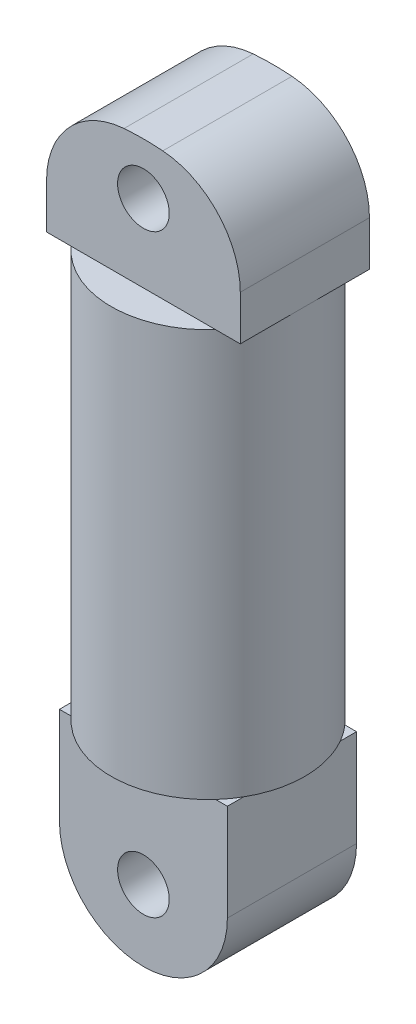
ISO-10303-21;
HEADER;
FILE_DESCRIPTION(('STEP AP214'),'2;1');
FILE_NAME('part.step','',(''),(''),'','','');
FILE_SCHEMA(('AUTOMOTIVE_DESIGN { 1 0 10303 214 1 1 1 1 }'));
ENDSEC;
DATA;
#1=APPLICATION_CONTEXT('core data for automotive mechanical design processes');
#2=APPLICATION_PROTOCOL_DEFINITION('international standard','automotive_design',2000,#1);
#3=PRODUCT_CONTEXT('',#1,'mechanical');
#4=PRODUCT('Part','Part','',(#3));
#5=PRODUCT_RELATED_PRODUCT_CATEGORY('part','',(#4));
#6=PRODUCT_DEFINITION_FORMATION('','',#4);
#7=PRODUCT_DEFINITION_CONTEXT('part definition',#1,'design');
#8=PRODUCT_DEFINITION('design','',#6,#7);
#9=PRODUCT_DEFINITION_SHAPE('','',#8);
#10=(LENGTH_UNIT() NAMED_UNIT(*) SI_UNIT(.MILLI.,.METRE.));
#11=(NAMED_UNIT(*) PLANE_ANGLE_UNIT() SI_UNIT($,.RADIAN.));
#12=(NAMED_UNIT(*) SI_UNIT($,.STERADIAN.) SOLID_ANGLE_UNIT());
#13=UNCERTAINTY_MEASURE_WITH_UNIT(LENGTH_MEASURE(1.E-05),#10,'distance_accuracy_value','');
#14=(GEOMETRIC_REPRESENTATION_CONTEXT(3) GLOBAL_UNCERTAINTY_ASSIGNED_CONTEXT((#13)) GLOBAL_UNIT_ASSIGNED_CONTEXT((#10,
#11,#12)) REPRESENTATION_CONTEXT('',''));
#15=CARTESIAN_POINT('',(0.,0.,0.));
#16=DIRECTION('',(0.,0.,1.));
#17=DIRECTION('',(1.,0.,0.));
#18=AXIS2_PLACEMENT_3D('',#15,#16,#17);
#19=CARTESIAN_POINT('',(0.,63.,0.));
#20=DIRECTION('',(0.,1.,0.));
#21=DIRECTION('',(0.,0.,1.));
#22=AXIS2_PLACEMENT_3D('',#19,#20,#21);
#23=PLANE('',#22);
#24=CARTESIAN_POINT('',(0.,63.,0.));
#25=DIRECTION('',(0.,1.,0.));
#26=DIRECTION('',(0.,0.,1.));
#27=AXIS2_PLACEMENT_3D('',#24,#25,#26);
#28=CIRCLE('',#27,15.);
#29=CARTESIAN_POINT('',(11.1803398874989,63.,-10.));
#30=VERTEX_POINT('',#29);
#31=CARTESIAN_POINT('',(-11.1803398874989,63.,-10.));
#32=VERTEX_POINT('',#31);
#33=EDGE_CURVE('E242',#30,#32,#28,.T.);
#34=ORIENTED_EDGE('',*,*,#33,.T.);
#35=DIRECTION('',(1.,0.,0.));
#36=VECTOR('',#35,1.);
#37=CARTESIAN_POINT('',(-15.,63.,-10.));
#38=LINE('',#37,#36);
#39=EDGE_CURVE('E11',#32,#30,#38,.T.);
#40=ORIENTED_EDGE('',*,*,#39,.T.);
#41=EDGE_LOOP('',(#34,#40));
#42=FACE_BOUND('',#41,.T.);
#43=ADVANCED_FACE('F36',(#42),#23,.T.);
#44=CARTESIAN_POINT('',(0.,0.,0.));
#45=DIRECTION('',(0.,1.,0.));
#46=DIRECTION('',(0.,0.,1.));
#47=AXIS2_PLACEMENT_3D('',#44,#45,#46);
#48=PLANE('',#47);
#49=DIRECTION('',(0.,0.,-1.));
#50=VECTOR('',#49,1.);
#51=CARTESIAN_POINT('',(-13.,0.,10.));
#52=LINE('',#51,#50);
#53=CARTESIAN_POINT('',(-13.,0.,7.48331477354789));
#54=VERTEX_POINT('',#53);
#55=CARTESIAN_POINT('',(-13.,0.,-7.48331477354789));
#56=VERTEX_POINT('',#55);
#57=EDGE_CURVE('E231',#54,#56,#52,.T.);
#58=ORIENTED_EDGE('',*,*,#57,.F.);
#59=CARTESIAN_POINT('',(0.,0.,0.));
#60=DIRECTION('',(0.,1.,0.));
#61=DIRECTION('',(0.,0.,1.));
#62=AXIS2_PLACEMENT_3D('',#59,#60,#61);
#63=CIRCLE('',#62,15.);
#64=EDGE_CURVE('E253',#56,#54,#63,.T.);
#65=ORIENTED_EDGE('',*,*,#64,.F.);
#66=EDGE_LOOP('',(#58,#65));
#67=FACE_BOUND('',#66,.T.);
#68=ADVANCED_FACE('F310',(#67),#48,.F.);
#69=DIRECTION('',(-1.,0.,0.));
#70=VECTOR('',#69,1.);
#71=CARTESIAN_POINT('',(-13.,0.,10.));
#72=LINE('',#71,#70);
#73=CARTESIAN_POINT('',(11.1803398874989,0.,10.));
#74=VERTEX_POINT('',#73);
#75=CARTESIAN_POINT('',(-11.1803398874989,0.,10.));
#76=VERTEX_POINT('',#75);
#77=EDGE_CURVE('E199',#74,#76,#72,.T.);
#78=ORIENTED_EDGE('',*,*,#77,.F.);
#79=EDGE_CURVE('E230',#76,#74,#63,.T.);
#80=ORIENTED_EDGE('',*,*,#79,.F.);
#81=EDGE_LOOP('',(#78,#80));
#82=FACE_BOUND('',#81,.T.);
#83=ADVANCED_FACE('F282',(#82),#48,.F.);
#84=CARTESIAN_POINT('',(11.1803398874989,0.,-10.));
#85=VERTEX_POINT('',#84);
#86=CARTESIAN_POINT('',(-11.1803398874989,0.,-10.));
#87=VERTEX_POINT('',#86);
#88=EDGE_CURVE('E258',#85,#87,#63,.T.);
#89=ORIENTED_EDGE('',*,*,#88,.F.);
#90=DIRECTION('',(-1.,0.,0.));
#91=VECTOR('',#90,1.);
#92=CARTESIAN_POINT('',(-13.,0.,-10.));
#93=LINE('',#92,#91);
#94=EDGE_CURVE('E210',#85,#87,#93,.T.);
#95=ORIENTED_EDGE('',*,*,#94,.T.);
#96=EDGE_LOOP('',(#89,#95));
#97=FACE_BOUND('',#96,.T.);
#98=ADVANCED_FACE('F323',(#97),#48,.F.);
#99=CARTESIAN_POINT('',(0.,63.,0.));
#100=DIRECTION('',(0.,-1.,0.));
#101=DIRECTION('',(0.,0.,-1.));
#102=AXIS2_PLACEMENT_3D('',#99,#100,#101);
#103=CYLINDRICAL_SURFACE('',#102,15.);
#104=CARTESIAN_POINT('',(11.1803398874989,63.,10.));
#105=VERTEX_POINT('',#104);
#106=CARTESIAN_POINT('',(15.,63.,0.));
#107=VERTEX_POINT('',#106);
#108=EDGE_CURVE('E232',#105,#107,#28,.T.);
#109=ORIENTED_EDGE('',*,*,#108,.F.);
#110=CARTESIAN_POINT('',(-11.1803398874989,63.,10.));
#111=VERTEX_POINT('',#110);
#112=EDGE_CURVE('E235',#111,#105,#28,.T.);
#113=ORIENTED_EDGE('',*,*,#112,.F.);
#114=CARTESIAN_POINT('',(-15.,63.,0.));
#115=VERTEX_POINT('',#114);
#116=EDGE_CURVE('E60',#115,#111,#28,.T.);
#117=ORIENTED_EDGE('',*,*,#116,.F.);
#118=EDGE_CURVE('E243',#32,#115,#28,.T.);
#119=ORIENTED_EDGE('',*,*,#118,.F.);
#120=ORIENTED_EDGE('',*,*,#33,.F.);
#121=EDGE_CURVE('E234',#107,#30,#28,.T.);
#122=ORIENTED_EDGE('',*,*,#121,.F.);
#123=EDGE_LOOP('',(#109,#113,#117,#119,#120,#122));
#124=FACE_BOUND('',#123,.T.);
#125=CARTESIAN_POINT('',(13.,0.,7.48331477354789));
#126=VERTEX_POINT('',#125);
#127=EDGE_CURVE('E40',#74,#126,#63,.T.);
#128=ORIENTED_EDGE('',*,*,#127,.T.);
#129=CARTESIAN_POINT('',(13.,0.,-7.48331477354789));
#130=VERTEX_POINT('',#129);
#131=EDGE_CURVE('E245',#126,#130,#63,.T.);
#132=ORIENTED_EDGE('',*,*,#131,.T.);
#133=EDGE_CURVE('E249',#130,#85,#63,.T.);
#134=ORIENTED_EDGE('',*,*,#133,.T.);
#135=ORIENTED_EDGE('',*,*,#88,.T.);
#136=EDGE_CURVE('E255',#87,#56,#63,.T.);
#137=ORIENTED_EDGE('',*,*,#136,.T.);
#138=ORIENTED_EDGE('',*,*,#64,.T.);
#139=EDGE_CURVE('E250',#54,#76,#63,.T.);
#140=ORIENTED_EDGE('',*,*,#139,.T.);
#141=ORIENTED_EDGE('',*,*,#79,.T.);
#142=EDGE_LOOP('',(#128,#132,#134,#135,#137,#138,#140,#141));
#143=FACE_BOUND('',#142,.T.);
#144=ADVANCED_FACE('F38',(#124,#143),#103,.T.);
#145=DIRECTION('',(1.,0.,0.));
#146=VECTOR('',#145,1.);
#147=CARTESIAN_POINT('',(-15.,63.,10.));
#148=LINE('',#147,#146);
#149=EDGE_CURVE('E45',#111,#105,#148,.T.);
#150=ORIENTED_EDGE('',*,*,#149,.F.);
#151=ORIENTED_EDGE('',*,*,#112,.T.);
#152=EDGE_LOOP('',(#150,#151));
#153=FACE_BOUND('',#152,.T.);
#154=ADVANCED_FACE('F312',(#153),#23,.T.);
#155=ORIENTED_EDGE('',*,*,#131,.F.);
#156=DIRECTION('',(0.,0.,-1.));
#157=VECTOR('',#156,1.);
#158=CARTESIAN_POINT('',(13.,0.,10.));
#159=LINE('',#158,#157);
#160=EDGE_CURVE('E221',#126,#130,#159,.T.);
#161=ORIENTED_EDGE('',*,*,#160,.T.);
#162=EDGE_LOOP('',(#155,#161));
#163=FACE_BOUND('',#162,.T.);
#164=ADVANCED_FACE('F268',(#163),#48,.F.);
#165=CARTESIAN_POINT('',(-13.,0.,10.));
#166=DIRECTION('',(0.,-1.,0.));
#167=DIRECTION('',(1.,0.,0.));
#168=AXIS2_PLACEMENT_3D('',#165,#166,#167);
#169=PLANE('',#168);
#170=ORIENTED_EDGE('',*,*,#127,.F.);
#171=CARTESIAN_POINT('',(13.,0.,10.));
#172=VERTEX_POINT('',#171);
#173=EDGE_CURVE('E194',#172,#74,#72,.T.);
#174=ORIENTED_EDGE('',*,*,#173,.F.);
#175=EDGE_CURVE('E217',#172,#126,#159,.T.);
#176=ORIENTED_EDGE('',*,*,#175,.T.);
#177=EDGE_LOOP('',(#170,#174,#176));
#178=FACE_BOUND('',#177,.T.);
#179=ADVANCED_FACE('F275',(#178),#169,.F.);
#180=ORIENTED_EDGE('',*,*,#133,.F.);
#181=CARTESIAN_POINT('',(13.,0.,-10.));
#182=VERTEX_POINT('',#181);
#183=EDGE_CURVE('E205',#130,#182,#159,.T.);
#184=ORIENTED_EDGE('',*,*,#183,.T.);
#185=EDGE_CURVE('E206',#182,#85,#93,.T.);
#186=ORIENTED_EDGE('',*,*,#185,.T.);
#187=EDGE_LOOP('',(#180,#184,#186));
#188=FACE_BOUND('',#187,.T.);
#189=ADVANCED_FACE('F265',(#188),#169,.F.);
#190=ORIENTED_EDGE('',*,*,#136,.F.);
#191=CARTESIAN_POINT('',(-13.,0.,-10.));
#192=VERTEX_POINT('',#191);
#193=EDGE_CURVE('E192',#87,#192,#93,.T.);
#194=ORIENTED_EDGE('',*,*,#193,.T.);
#195=EDGE_CURVE('E227',#56,#192,#52,.T.);
#196=ORIENTED_EDGE('',*,*,#195,.F.);
#197=EDGE_LOOP('',(#190,#194,#196));
#198=FACE_BOUND('',#197,.T.);
#199=ADVANCED_FACE('F296',(#198),#169,.F.);
#200=CARTESIAN_POINT('',(0.,-15.,10.));
#201=DIRECTION('',(0.,0.,1.));
#202=DIRECTION('',(1.,0.,0.));
#203=AXIS2_PLACEMENT_3D('',#200,#201,#202);
#204=PLANE('',#203);
#205=ORIENTED_EDGE('',*,*,#173,.T.);
#206=ORIENTED_EDGE('',*,*,#77,.T.);
#207=CARTESIAN_POINT('',(-13.,0.,10.));
#208=VERTEX_POINT('',#207);
#209=EDGE_CURVE('E198',#76,#208,#72,.T.);
#210=ORIENTED_EDGE('',*,*,#209,.T.);
#211=DIRECTION('',(0.,-1.,0.));
#212=VECTOR('',#211,1.);
#213=CARTESIAN_POINT('',(-13.,0.,10.));
#214=LINE('',#213,#212);
#215=CARTESIAN_POINT('',(-13.,-15.,10.));
#216=VERTEX_POINT('',#215);
#217=EDGE_CURVE('E197',#208,#216,#214,.T.);
#218=ORIENTED_EDGE('',*,*,#217,.T.);
#219=CARTESIAN_POINT('',(0.,-15.,10.));
#220=DIRECTION('',(0.,0.,1.));
#221=DIRECTION('',(1.,0.,0.));
#222=AXIS2_PLACEMENT_3D('',#219,#220,#221);
#223=CIRCLE('',#222,13.);
#224=CARTESIAN_POINT('',(13.,-15.,10.));
#225=VERTEX_POINT('',#224);
#226=EDGE_CURVE('E201',#216,#225,#223,.T.);
#227=ORIENTED_EDGE('',*,*,#226,.T.);
#228=DIRECTION('',(0.,1.,0.));
#229=VECTOR('',#228,1.);
#230=CARTESIAN_POINT('',(13.,0.,10.));
#231=LINE('',#230,#229);
#232=EDGE_CURVE('E203',#225,#172,#231,.T.);
#233=ORIENTED_EDGE('',*,*,#232,.T.);
#234=EDGE_LOOP('',(#205,#206,#210,#218,#227,#233));
#235=FACE_BOUND('',#234,.T.);
#236=CARTESIAN_POINT('',(0.,-17.,10.));
#237=DIRECTION('',(0.,0.,1.));
#238=DIRECTION('',(1.,0.,0.));
#239=AXIS2_PLACEMENT_3D('',#236,#237,#238);
#240=CIRCLE('',#239,4.);
#241=CARTESIAN_POINT('',(4.,-17.,10.));
#242=VERTEX_POINT('',#241);
#243=EDGE_CURVE('E185',#242,#242,#240,.T.);
#244=ORIENTED_EDGE('',*,*,#243,.F.);
#245=EDGE_LOOP('',(#244));
#246=FACE_BOUND('',#245,.T.);
#247=ADVANCED_FACE('F279',(#235,#246),#204,.T.);
#248=CARTESIAN_POINT('',(0.,-15.,-10.));
#249=DIRECTION('',(0.,0.,1.));
#250=DIRECTION('',(1.,0.,0.));
#251=AXIS2_PLACEMENT_3D('',#248,#249,#250);
#252=PLANE('',#251);
#253=ORIENTED_EDGE('',*,*,#185,.F.);
#254=DIRECTION('',(0.,1.,0.));
#255=VECTOR('',#254,1.);
#256=CARTESIAN_POINT('',(13.,0.,-10.));
#257=LINE('',#256,#255);
#258=CARTESIAN_POINT('',(13.,-15.,-10.));
#259=VERTEX_POINT('',#258);
#260=EDGE_CURVE('E214',#259,#182,#257,.T.);
#261=ORIENTED_EDGE('',*,*,#260,.F.);
#262=CARTESIAN_POINT('',(0.,-15.,-10.));
#263=DIRECTION('',(0.,0.,1.));
#264=DIRECTION('',(1.,0.,0.));
#265=AXIS2_PLACEMENT_3D('',#262,#263,#264);
#266=CIRCLE('',#265,13.);
#267=CARTESIAN_POINT('',(-13.,-15.,-10.));
#268=VERTEX_POINT('',#267);
#269=EDGE_CURVE('E212',#268,#259,#266,.T.);
#270=ORIENTED_EDGE('',*,*,#269,.F.);
#271=DIRECTION('',(0.,-1.,0.));
#272=VECTOR('',#271,1.);
#273=CARTESIAN_POINT('',(-13.,0.,-10.));
#274=LINE('',#273,#272);
#275=EDGE_CURVE('E209',#192,#268,#274,.T.);
#276=ORIENTED_EDGE('',*,*,#275,.F.);
#277=ORIENTED_EDGE('',*,*,#193,.F.);
#278=ORIENTED_EDGE('',*,*,#94,.F.);
#279=EDGE_LOOP('',(#253,#261,#270,#276,#277,#278));
#280=FACE_BOUND('',#279,.T.);
#281=CARTESIAN_POINT('',(0.,-17.,-10.));
#282=DIRECTION('',(0.,0.,1.));
#283=DIRECTION('',(1.,0.,0.));
#284=AXIS2_PLACEMENT_3D('',#281,#282,#283);
#285=CIRCLE('',#284,4.);
#286=CARTESIAN_POINT('',(4.,-17.,-10.));
#287=VERTEX_POINT('',#286);
#288=EDGE_CURVE('E182',#287,#287,#285,.T.);
#289=ORIENTED_EDGE('',*,*,#288,.T.);
#290=EDGE_LOOP('',(#289));
#291=FACE_BOUND('',#290,.T.);
#292=ADVANCED_FACE('F294',(#280,#291),#252,.F.);
#293=ORIENTED_EDGE('',*,*,#139,.F.);
#294=EDGE_CURVE('E228',#208,#54,#52,.T.);
#295=ORIENTED_EDGE('',*,*,#294,.F.);
#296=ORIENTED_EDGE('',*,*,#209,.F.);
#297=EDGE_LOOP('',(#293,#295,#296));
#298=FACE_BOUND('',#297,.T.);
#299=ADVANCED_FACE('F292',(#298),#169,.F.);
#300=CARTESIAN_POINT('',(-13.,0.,10.));
#301=DIRECTION('',(1.,0.,0.));
#302=DIRECTION('',(0.,0.,-1.));
#303=AXIS2_PLACEMENT_3D('',#300,#301,#302);
#304=PLANE('',#303);
#305=ORIENTED_EDGE('',*,*,#275,.T.);
#306=DIRECTION('',(0.,0.,-1.));
#307=VECTOR('',#306,1.);
#308=CARTESIAN_POINT('',(-13.,-15.,10.));
#309=LINE('',#308,#307);
#310=EDGE_CURVE('E224',#216,#268,#309,.T.);
#311=ORIENTED_EDGE('',*,*,#310,.F.);
#312=ORIENTED_EDGE('',*,*,#217,.F.);
#313=ORIENTED_EDGE('',*,*,#294,.T.);
#314=ORIENTED_EDGE('',*,*,#57,.T.);
#315=ORIENTED_EDGE('',*,*,#195,.T.);
#316=EDGE_LOOP('',(#305,#311,#312,#313,#314,#315));
#317=FACE_BOUND('',#316,.T.);
#318=ADVANCED_FACE('F289',(#317),#304,.F.);
#319=CARTESIAN_POINT('',(0.,-15.,10.));
#320=DIRECTION('',(0.,0.,-1.));
#321=DIRECTION('',(-1.,0.,0.));
#322=AXIS2_PLACEMENT_3D('',#319,#320,#321);
#323=CYLINDRICAL_SURFACE('',#322,13.);
#324=ORIENTED_EDGE('',*,*,#269,.T.);
#325=DIRECTION('',(0.,0.,-1.));
#326=VECTOR('',#325,1.);
#327=CARTESIAN_POINT('',(13.,-15.,10.));
#328=LINE('',#327,#326);
#329=EDGE_CURVE('E220',#225,#259,#328,.T.);
#330=ORIENTED_EDGE('',*,*,#329,.F.);
#331=ORIENTED_EDGE('',*,*,#226,.F.);
#332=ORIENTED_EDGE('',*,*,#310,.T.);
#333=EDGE_LOOP('',(#324,#330,#331,#332));
#334=FACE_BOUND('',#333,.T.);
#335=ADVANCED_FACE('F301',(#334),#323,.T.);
#336=CARTESIAN_POINT('',(13.,0.,10.));
#337=DIRECTION('',(-1.,0.,0.));
#338=DIRECTION('',(0.,-1.,0.));
#339=AXIS2_PLACEMENT_3D('',#336,#337,#338);
#340=PLANE('',#339);
#341=ORIENTED_EDGE('',*,*,#260,.T.);
#342=ORIENTED_EDGE('',*,*,#183,.F.);
#343=ORIENTED_EDGE('',*,*,#160,.F.);
#344=ORIENTED_EDGE('',*,*,#175,.F.);
#345=ORIENTED_EDGE('',*,*,#232,.F.);
#346=ORIENTED_EDGE('',*,*,#329,.T.);
#347=EDGE_LOOP('',(#341,#342,#343,#344,#345,#346));
#348=FACE_BOUND('',#347,.T.);
#349=ADVANCED_FACE('F271',(#348),#340,.F.);
#350=CARTESIAN_POINT('',(0.,-17.,10.));
#351=DIRECTION('',(0.,0.,-1.));
#352=DIRECTION('',(-1.,0.,0.));
#353=AXIS2_PLACEMENT_3D('',#350,#351,#352);
#354=CYLINDRICAL_SURFACE('',#353,4.);
#355=ORIENTED_EDGE('',*,*,#243,.T.);
#356=EDGE_LOOP('',(#355));
#357=FACE_BOUND('',#356,.T.);
#358=ORIENTED_EDGE('',*,*,#288,.F.);
#359=EDGE_LOOP('',(#358));
#360=FACE_BOUND('',#359,.T.);
#361=ADVANCED_FACE('F399',(#357,#360),#354,.F.);
#362=CARTESIAN_POINT('',(-15.,63.,10.));
#363=DIRECTION('',(0.,1.,0.));
#364=DIRECTION('',(0.,0.,1.));
#365=AXIS2_PLACEMENT_3D('',#362,#363,#364);
#366=PLANE('',#365);
#367=CARTESIAN_POINT('',(15.,63.,10.));
#368=VERTEX_POINT('',#367);
#369=EDGE_CURVE('E165',#105,#368,#148,.T.);
#370=ORIENTED_EDGE('',*,*,#369,.F.);
#371=ORIENTED_EDGE('',*,*,#108,.T.);
#372=DIRECTION('',(0.,0.,-1.));
#373=VECTOR('',#372,1.);
#374=CARTESIAN_POINT('',(15.,63.,10.));
#375=LINE('',#374,#373);
#376=EDGE_CURVE('E187',#368,#107,#375,.T.);
#377=ORIENTED_EDGE('',*,*,#376,.F.);
#378=EDGE_LOOP('',(#370,#371,#377));
#379=FACE_BOUND('',#378,.T.);
#380=ADVANCED_FACE('F371',(#379),#366,.F.);
#381=CARTESIAN_POINT('',(15.,63.,-10.));
#382=VERTEX_POINT('',#381);
#383=EDGE_CURVE('E334',#107,#382,#375,.T.);
#384=ORIENTED_EDGE('',*,*,#383,.F.);
#385=ORIENTED_EDGE('',*,*,#121,.T.);
#386=EDGE_CURVE('E48',#30,#382,#38,.T.);
#387=ORIENTED_EDGE('',*,*,#386,.T.);
#388=EDGE_LOOP('',(#384,#385,#387));
#389=FACE_BOUND('',#388,.T.);
#390=ADVANCED_FACE('F332',(#389),#366,.F.);
#391=CARTESIAN_POINT('',(-15.,63.,-10.));
#392=VERTEX_POINT('',#391);
#393=EDGE_CURVE('E47',#392,#32,#38,.T.);
#394=ORIENTED_EDGE('',*,*,#393,.T.);
#395=ORIENTED_EDGE('',*,*,#118,.T.);
#396=DIRECTION('',(0.,0.,-1.));
#397=VECTOR('',#396,1.);
#398=CARTESIAN_POINT('',(-15.,63.,10.));
#399=LINE('',#398,#397);
#400=EDGE_CURVE('E181',#115,#392,#399,.T.);
#401=ORIENTED_EDGE('',*,*,#400,.T.);
#402=EDGE_LOOP('',(#394,#395,#401));
#403=FACE_BOUND('',#402,.T.);
#404=ADVANCED_FACE('F389',(#403),#366,.F.);
#405=CARTESIAN_POINT('',(-15.,63.,10.));
#406=VERTEX_POINT('',#405);
#407=EDGE_CURVE('E162',#406,#115,#399,.T.);
#408=ORIENTED_EDGE('',*,*,#407,.T.);
#409=ORIENTED_EDGE('',*,*,#116,.T.);
#410=EDGE_CURVE('E158',#406,#111,#148,.T.);
#411=ORIENTED_EDGE('',*,*,#410,.F.);
#412=EDGE_LOOP('',(#408,#409,#411));
#413=FACE_BOUND('',#412,.T.);
#414=ADVANCED_FACE('F160',(#413),#366,.F.);
#415=CARTESIAN_POINT('',(-2.,69.9229627936314,10.));
#416=DIRECTION('',(0.,0.,1.));
#417=DIRECTION('',(1.,0.,0.));
#418=AXIS2_PLACEMENT_3D('',#415,#416,#417);
#419=PLANE('',#418);
#420=DIRECTION('',(0.,-1.,0.));
#421=VECTOR('',#420,1.);
#422=CARTESIAN_POINT('',(-15.,63.,10.));
#423=LINE('',#422,#421);
#424=CARTESIAN_POINT('',(-15.,69.9229627936314,10.));
#425=VERTEX_POINT('',#424);
#426=EDGE_CURVE('E168',#425,#406,#423,.T.);
#427=ORIENTED_EDGE('',*,*,#426,.T.);
#428=ORIENTED_EDGE('',*,*,#410,.T.);
#429=ORIENTED_EDGE('',*,*,#149,.T.);
#430=ORIENTED_EDGE('',*,*,#369,.T.);
#431=DIRECTION('',(0.,1.,0.));
#432=VECTOR('',#431,1.);
#433=CARTESIAN_POINT('',(15.,63.,10.));
#434=LINE('',#433,#432);
#435=CARTESIAN_POINT('',(15.,69.9229627936314,10.));
#436=VERTEX_POINT('',#435);
#437=EDGE_CURVE('E164',#368,#436,#434,.T.);
#438=ORIENTED_EDGE('',*,*,#437,.T.);
#439=CARTESIAN_POINT('',(2.,69.9229627936314,10.));
#440=DIRECTION('',(0.,0.,1.));
#441=DIRECTION('',(-1.,0.,0.));
#442=AXIS2_PLACEMENT_3D('',#439,#440,#441);
#443=CIRCLE('',#442,13.);
#444=CARTESIAN_POINT('',(3.,82.8844441904472,10.));
#445=VERTEX_POINT('',#444);
#446=EDGE_CURVE('E376',#436,#445,#443,.T.);
#447=ORIENTED_EDGE('',*,*,#446,.T.);
#448=CARTESIAN_POINT('',(0.,44.,10.));
#449=DIRECTION('',(0.,0.,1.));
#450=DIRECTION('',(-1.,0.,0.));
#451=AXIS2_PLACEMENT_3D('',#448,#449,#450);
#452=CIRCLE('',#451,39.);
#453=CARTESIAN_POINT('',(-3.,82.8844441904472,10.));
#454=VERTEX_POINT('',#453);
#455=EDGE_CURVE('E378',#445,#454,#452,.T.);
#456=ORIENTED_EDGE('',*,*,#455,.T.);
#457=CARTESIAN_POINT('',(-2.,69.9229627936314,10.));
#458=DIRECTION('',(0.,0.,1.));
#459=DIRECTION('',(1.,0.,0.));
#460=AXIS2_PLACEMENT_3D('',#457,#458,#459);
#461=CIRCLE('',#460,13.);
#462=EDGE_CURVE('E172',#454,#425,#461,.T.);
#463=ORIENTED_EDGE('',*,*,#462,.T.);
#464=EDGE_LOOP('',(#427,#428,#429,#430,#438,#447,#456,#463));
#465=FACE_BOUND('',#464,.T.);
#466=CARTESIAN_POINT('',(0.,75.,10.));
#467=DIRECTION('',(0.,0.,1.));
#468=DIRECTION('',(-1.,0.,0.));
#469=AXIS2_PLACEMENT_3D('',#466,#467,#468);
#470=CIRCLE('',#469,4.);
#471=CARTESIAN_POINT('',(-4.,75.,10.));
#472=VERTEX_POINT('',#471);
#473=EDGE_CURVE('E346',#472,#472,#470,.T.);
#474=ORIENTED_EDGE('',*,*,#473,.F.);
#475=EDGE_LOOP('',(#474));
#476=FACE_BOUND('',#475,.T.);
#477=ADVANCED_FACE('F169',(#465,#476),#419,.T.);
#478=CARTESIAN_POINT('',(-2.,69.9229627936314,-10.));
#479=DIRECTION('',(0.,0.,1.));
#480=DIRECTION('',(1.,0.,0.));
#481=AXIS2_PLACEMENT_3D('',#478,#479,#480);
#482=PLANE('',#481);
#483=DIRECTION('',(0.,-1.,0.));
#484=VECTOR('',#483,1.);
#485=CARTESIAN_POINT('',(-15.,63.,-10.));
#486=LINE('',#485,#484);
#487=CARTESIAN_POINT('',(-15.,69.9229627936314,-10.));
#488=VERTEX_POINT('',#487);
#489=EDGE_CURVE('E345',#488,#392,#486,.T.);
#490=ORIENTED_EDGE('',*,*,#489,.F.);
#491=CARTESIAN_POINT('',(-2.,69.9229627936314,-10.));
#492=DIRECTION('',(0.,0.,1.));
#493=DIRECTION('',(1.,0.,0.));
#494=AXIS2_PLACEMENT_3D('',#491,#492,#493);
#495=CIRCLE('',#494,13.);
#496=CARTESIAN_POINT('',(-3.,82.8844441904472,-10.));
#497=VERTEX_POINT('',#496);
#498=EDGE_CURVE('E176',#497,#488,#495,.T.);
#499=ORIENTED_EDGE('',*,*,#498,.F.);
#500=CARTESIAN_POINT('',(0.,44.,-10.));
#501=DIRECTION('',(0.,0.,1.));
#502=DIRECTION('',(-1.,0.,0.));
#503=AXIS2_PLACEMENT_3D('',#500,#501,#502);
#504=CIRCLE('',#503,39.);
#505=CARTESIAN_POINT('',(3.,82.8844441904472,-10.));
#506=VERTEX_POINT('',#505);
#507=EDGE_CURVE('E353',#506,#497,#504,.T.);
#508=ORIENTED_EDGE('',*,*,#507,.F.);
#509=CARTESIAN_POINT('',(2.,69.9229627936314,-10.));
#510=DIRECTION('',(0.,0.,1.));
#511=DIRECTION('',(-1.,0.,0.));
#512=AXIS2_PLACEMENT_3D('',#509,#510,#511);
#513=CIRCLE('',#512,13.);
#514=CARTESIAN_POINT('',(15.,69.9229627936314,-10.));
#515=VERTEX_POINT('',#514);
#516=EDGE_CURVE('E351',#515,#506,#513,.T.);
#517=ORIENTED_EDGE('',*,*,#516,.F.);
#518=DIRECTION('',(0.,1.,0.));
#519=VECTOR('',#518,1.);
#520=CARTESIAN_POINT('',(15.,63.,-10.));
#521=LINE('',#520,#519);
#522=EDGE_CURVE('E344',#382,#515,#521,.T.);
#523=ORIENTED_EDGE('',*,*,#522,.F.);
#524=ORIENTED_EDGE('',*,*,#386,.F.);
#525=ORIENTED_EDGE('',*,*,#39,.F.);
#526=ORIENTED_EDGE('',*,*,#393,.F.);
#527=EDGE_LOOP('',(#490,#499,#508,#517,#523,#524,#525,#526));
#528=FACE_BOUND('',#527,.T.);
#529=CARTESIAN_POINT('',(0.,75.,-10.));
#530=DIRECTION('',(0.,0.,1.));
#531=DIRECTION('',(-1.,0.,0.));
#532=AXIS2_PLACEMENT_3D('',#529,#530,#531);
#533=CIRCLE('',#532,4.);
#534=CARTESIAN_POINT('',(-4.,75.,-10.));
#535=VERTEX_POINT('',#534);
#536=EDGE_CURVE('E523',#535,#535,#533,.T.);
#537=ORIENTED_EDGE('',*,*,#536,.T.);
#538=EDGE_LOOP('',(#537));
#539=FACE_BOUND('',#538,.T.);
#540=ADVANCED_FACE('F339',(#528,#539),#482,.F.);
#541=CARTESIAN_POINT('',(-15.,63.,10.));
#542=DIRECTION('',(1.,0.,0.));
#543=DIRECTION('',(0.,0.,-1.));
#544=AXIS2_PLACEMENT_3D('',#541,#542,#543);
#545=PLANE('',#544);
#546=ORIENTED_EDGE('',*,*,#489,.T.);
#547=ORIENTED_EDGE('',*,*,#400,.F.);
#548=ORIENTED_EDGE('',*,*,#407,.F.);
#549=ORIENTED_EDGE('',*,*,#426,.F.);
#550=DIRECTION('',(0.,0.,-1.));
#551=VECTOR('',#550,1.);
#552=CARTESIAN_POINT('',(-15.,69.9229627936314,10.));
#553=LINE('',#552,#551);
#554=EDGE_CURVE('E356',#425,#488,#553,.T.);
#555=ORIENTED_EDGE('',*,*,#554,.T.);
#556=EDGE_LOOP('',(#546,#547,#548,#549,#555));
#557=FACE_BOUND('',#556,.T.);
#558=ADVANCED_FACE('F180',(#557),#545,.F.);
#559=CARTESIAN_POINT('',(15.,63.,10.));
#560=DIRECTION('',(-1.,0.,0.));
#561=DIRECTION('',(0.,0.,1.));
#562=AXIS2_PLACEMENT_3D('',#559,#560,#561);
#563=PLANE('',#562);
#564=ORIENTED_EDGE('',*,*,#522,.T.);
#565=DIRECTION('',(0.,0.,-1.));
#566=VECTOR('',#565,1.);
#567=CARTESIAN_POINT('',(15.,69.9229627936314,10.));
#568=LINE('',#567,#566);
#569=EDGE_CURVE('E363',#436,#515,#568,.T.);
#570=ORIENTED_EDGE('',*,*,#569,.F.);
#571=ORIENTED_EDGE('',*,*,#437,.F.);
#572=ORIENTED_EDGE('',*,*,#376,.T.);
#573=ORIENTED_EDGE('',*,*,#383,.T.);
#574=EDGE_LOOP('',(#564,#570,#571,#572,#573));
#575=FACE_BOUND('',#574,.T.);
#576=ADVANCED_FACE('F370',(#575),#563,.F.);
#577=CARTESIAN_POINT('',(2.,69.9229627936314,10.));
#578=DIRECTION('',(0.,0.,-1.));
#579=DIRECTION('',(-1.,0.,0.));
#580=AXIS2_PLACEMENT_3D('',#577,#578,#579);
#581=CYLINDRICAL_SURFACE('',#580,13.);
#582=ORIENTED_EDGE('',*,*,#516,.T.);
#583=DIRECTION('',(0.,0.,-1.));
#584=VECTOR('',#583,1.);
#585=CARTESIAN_POINT('',(3.,82.8844441904472,10.));
#586=LINE('',#585,#584);
#587=EDGE_CURVE('E361',#445,#506,#586,.T.);
#588=ORIENTED_EDGE('',*,*,#587,.F.);
#589=ORIENTED_EDGE('',*,*,#446,.F.);
#590=ORIENTED_EDGE('',*,*,#569,.T.);
#591=EDGE_LOOP('',(#582,#588,#589,#590));
#592=FACE_BOUND('',#591,.T.);
#593=ADVANCED_FACE('F482',(#592),#581,.T.);
#594=CARTESIAN_POINT('',(0.,44.,10.));
#595=DIRECTION('',(0.,0.,-1.));
#596=DIRECTION('',(-1.,0.,0.));
#597=AXIS2_PLACEMENT_3D('',#594,#595,#596);
#598=CYLINDRICAL_SURFACE('',#597,39.);
#599=ORIENTED_EDGE('',*,*,#507,.T.);
#600=DIRECTION('',(0.,0.,-1.));
#601=VECTOR('',#600,1.);
#602=CARTESIAN_POINT('',(-3.,82.8844441904472,10.));
#603=LINE('',#602,#601);
#604=EDGE_CURVE('E358',#454,#497,#603,.T.);
#605=ORIENTED_EDGE('',*,*,#604,.F.);
#606=ORIENTED_EDGE('',*,*,#455,.F.);
#607=ORIENTED_EDGE('',*,*,#587,.T.);
#608=EDGE_LOOP('',(#599,#605,#606,#607));
#609=FACE_BOUND('',#608,.T.);
#610=ADVANCED_FACE('F383',(#609),#598,.T.);
#611=CARTESIAN_POINT('',(-2.,69.9229627936314,10.));
#612=DIRECTION('',(0.,0.,-1.));
#613=DIRECTION('',(-1.,0.,0.));
#614=AXIS2_PLACEMENT_3D('',#611,#612,#613);
#615=CYLINDRICAL_SURFACE('',#614,13.);
#616=ORIENTED_EDGE('',*,*,#498,.T.);
#617=ORIENTED_EDGE('',*,*,#554,.F.);
#618=ORIENTED_EDGE('',*,*,#462,.F.);
#619=ORIENTED_EDGE('',*,*,#604,.T.);
#620=EDGE_LOOP('',(#616,#617,#618,#619));
#621=FACE_BOUND('',#620,.T.);
#622=ADVANCED_FACE('F387',(#621),#615,.T.);
#623=CARTESIAN_POINT('',(0.,75.,10.));
#624=DIRECTION('',(0.,0.,-1.));
#625=DIRECTION('',(-1.,0.,0.));
#626=AXIS2_PLACEMENT_3D('',#623,#624,#625);
#627=CYLINDRICAL_SURFACE('',#626,4.);
#628=ORIENTED_EDGE('',*,*,#473,.T.);
#629=EDGE_LOOP('',(#628));
#630=FACE_BOUND('',#629,.T.);
#631=ORIENTED_EDGE('',*,*,#536,.F.);
#632=EDGE_LOOP('',(#631));
#633=FACE_BOUND('',#632,.T.);
#634=ADVANCED_FACE('F505',(#630,#633),#627,.F.);
#635=CLOSED_SHELL('',(#43,#68,#83,#98,#144,#154,#164,#179,#189,#199,#247,#292,#299,#318,#335,
#349,#361,#380,#390,#404,#414,#477,#540,#558,#576,#593,#610,#622,#634));
#636=MANIFOLD_SOLID_BREP('B2',#635);
#637=ADVANCED_BREP_SHAPE_REPRESENTATION('',(#18,#636),#14);
#638=SHAPE_DEFINITION_REPRESENTATION(#9,#637);
ENDSEC;
END-ISO-10303-21;
